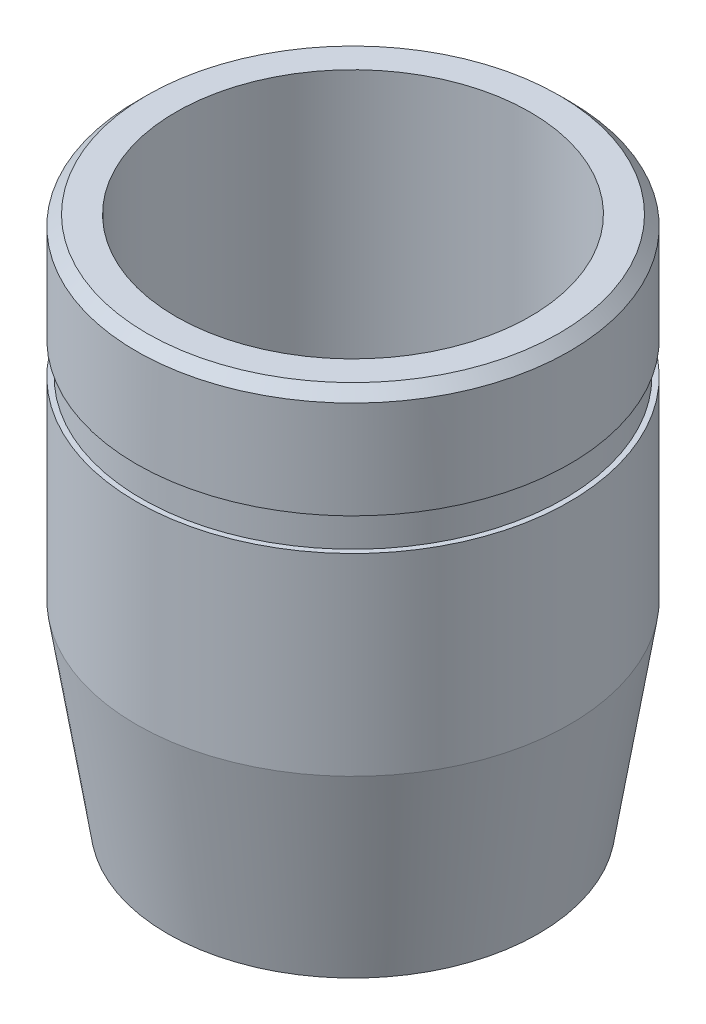
ISO-10303-21;
HEADER;
FILE_DESCRIPTION(('STEP AP214'),'2;1');
FILE_NAME('part.step','',(''),(''),'','','');
FILE_SCHEMA(('AUTOMOTIVE_DESIGN { 1 0 10303 214 1 1 1 1 }'));
ENDSEC;
DATA;
#1=APPLICATION_CONTEXT('core data for automotive mechanical design processes');
#2=APPLICATION_PROTOCOL_DEFINITION('international standard','automotive_design',2000,#1);
#3=PRODUCT_CONTEXT('',#1,'mechanical');
#4=PRODUCT('Part','Part','',(#3));
#5=PRODUCT_RELATED_PRODUCT_CATEGORY('part','',(#4));
#6=PRODUCT_DEFINITION_FORMATION('','',#4);
#7=PRODUCT_DEFINITION_CONTEXT('part definition',#1,'design');
#8=PRODUCT_DEFINITION('design','',#6,#7);
#9=PRODUCT_DEFINITION_SHAPE('','',#8);
#10=(LENGTH_UNIT() NAMED_UNIT(*) SI_UNIT(.MILLI.,.METRE.));
#11=(NAMED_UNIT(*) PLANE_ANGLE_UNIT() SI_UNIT($,.RADIAN.));
#12=(NAMED_UNIT(*) SI_UNIT($,.STERADIAN.) SOLID_ANGLE_UNIT());
#13=UNCERTAINTY_MEASURE_WITH_UNIT(LENGTH_MEASURE(1.E-05),#10,'distance_accuracy_value','');
#14=(GEOMETRIC_REPRESENTATION_CONTEXT(3) GLOBAL_UNCERTAINTY_ASSIGNED_CONTEXT((#13)) GLOBAL_UNIT_ASSIGNED_CONTEXT((#10,
#11,#12)) REPRESENTATION_CONTEXT('',''));
#15=CARTESIAN_POINT('',(0.,0.,0.));
#16=DIRECTION('',(0.,0.,1.));
#17=DIRECTION('',(1.,0.,0.));
#18=AXIS2_PLACEMENT_3D('',#15,#16,#17);
#19=CARTESIAN_POINT('',(0.,0.,0.));
#20=DIRECTION('',(0.,-1.,0.));
#21=DIRECTION('',(0.,0.,-1.));
#22=AXIS2_PLACEMENT_3D('',#19,#20,#21);
#23=CYLINDRICAL_SURFACE('',#22,15.494);
#24=CARTESIAN_POINT('',(0.,30.9626,0.));
#25=DIRECTION('',(0.,-1.,0.));
#26=DIRECTION('',(0.,0.,-1.));
#27=AXIS2_PLACEMENT_3D('',#24,#25,#26);
#28=CIRCLE('',#27,15.494);
#29=CARTESIAN_POINT('',(0.,30.9626,-15.494));
#30=VERTEX_POINT('',#29);
#31=EDGE_CURVE('E44',#30,#30,#28,.F.);
#32=ORIENTED_EDGE('',*,*,#31,.F.);
#33=EDGE_LOOP('',(#32));
#34=FACE_BOUND('',#33,.T.);
#35=CARTESIAN_POINT('',(0.,28.575,0.));
#36=DIRECTION('',(0.,-1.,0.));
#37=DIRECTION('',(0.,0.,-1.));
#38=AXIS2_PLACEMENT_3D('',#35,#36,#37);
#39=CIRCLE('',#38,15.494);
#40=CARTESIAN_POINT('',(0.,28.575,-15.494));
#41=VERTEX_POINT('',#40);
#42=EDGE_CURVE('E18',#41,#41,#39,.T.);
#43=ORIENTED_EDGE('',*,*,#42,.F.);
#44=EDGE_LOOP('',(#43));
#45=FACE_BOUND('',#44,.T.);
#46=ADVANCED_FACE('F15',(#34,#45),#23,.T.);
#47=CARTESIAN_POINT('',(15.875,28.575,0.));
#48=DIRECTION('',(0.,1.,0.));
#49=DIRECTION('',(0.,0.,1.));
#50=AXIS2_PLACEMENT_3D('',#47,#48,#49);
#51=PLANE('',#50);
#52=CARTESIAN_POINT('',(0.,28.575,0.));
#53=DIRECTION('',(0.,-1.,0.));
#54=DIRECTION('',(0.,0.,-1.));
#55=AXIS2_PLACEMENT_3D('',#52,#53,#54);
#56=CIRCLE('',#55,15.875);
#57=CARTESIAN_POINT('',(0.,28.575,-15.875));
#58=VERTEX_POINT('',#57);
#59=EDGE_CURVE('E42',#58,#58,#56,.T.);
#60=ORIENTED_EDGE('',*,*,#59,.F.);
#61=EDGE_LOOP('',(#60));
#62=FACE_BOUND('',#61,.T.);
#63=ORIENTED_EDGE('',*,*,#42,.T.);
#64=EDGE_LOOP('',(#63));
#65=FACE_BOUND('',#64,.T.);
#66=ADVANCED_FACE('F51',(#62,#65),#51,.T.);
#67=CARTESIAN_POINT('',(15.494,30.9626,0.));
#68=DIRECTION('',(0.,-1.,0.));
#69=DIRECTION('',(0.,0.,-1.));
#70=AXIS2_PLACEMENT_3D('',#67,#68,#69);
#71=PLANE('',#70);
#72=ORIENTED_EDGE('',*,*,#31,.T.);
#73=EDGE_LOOP('',(#72));
#74=FACE_BOUND('',#73,.T.);
#75=CARTESIAN_POINT('',(0.,30.9626,0.));
#76=DIRECTION('',(0.,-1.,0.));
#77=DIRECTION('',(0.,0.,-1.));
#78=AXIS2_PLACEMENT_3D('',#75,#76,#77);
#79=CIRCLE('',#78,15.875);
#80=CARTESIAN_POINT('',(0.,30.9626,-15.875));
#81=VERTEX_POINT('',#80);
#82=EDGE_CURVE('E39',#81,#81,#79,.F.);
#83=ORIENTED_EDGE('',*,*,#82,.F.);
#84=EDGE_LOOP('',(#83));
#85=FACE_BOUND('',#84,.T.);
#86=ADVANCED_FACE('F59',(#74,#85),#71,.T.);
#87=CARTESIAN_POINT('',(0.,0.,0.));
#88=DIRECTION('',(0.,-1.,0.));
#89=DIRECTION('',(0.,0.,-1.));
#90=AXIS2_PLACEMENT_3D('',#87,#88,#89);
#91=CYLINDRICAL_SURFACE('',#90,15.875);
#92=CARTESIAN_POINT('',(0.,14.4272,0.));
#93=DIRECTION('',(0.,1.,0.));
#94=DIRECTION('',(0.,0.,1.));
#95=AXIS2_PLACEMENT_3D('',#92,#93,#94);
#96=CIRCLE('',#95,15.875);
#97=CARTESIAN_POINT('',(0.,14.4272,15.875));
#98=VERTEX_POINT('',#97);
#99=EDGE_CURVE('E30',#98,#98,#96,.F.);
#100=ORIENTED_EDGE('',*,*,#99,.F.);
#101=EDGE_LOOP('',(#100));
#102=FACE_BOUND('',#101,.T.);
#103=ORIENTED_EDGE('',*,*,#59,.T.);
#104=EDGE_LOOP('',(#103));
#105=FACE_BOUND('',#104,.T.);
#106=ADVANCED_FACE('F89',(#102,#105),#91,.T.);
#107=CARTESIAN_POINT('',(0.,0.,0.));
#108=DIRECTION('',(0.,-1.,0.));
#109=DIRECTION('',(0.,0.,-1.));
#110=AXIS2_PLACEMENT_3D('',#107,#108,#109);
#111=CYLINDRICAL_SURFACE('',#110,15.875);
#112=CARTESIAN_POINT('',(0.,38.1254,0.));
#113=DIRECTION('',(0.,-1.,0.));
#114=DIRECTION('',(0.,0.,-1.));
#115=AXIS2_PLACEMENT_3D('',#112,#113,#114);
#116=CIRCLE('',#115,15.875);
#117=CARTESIAN_POINT('',(0.,38.1254,-15.875));
#118=VERTEX_POINT('',#117);
#119=EDGE_CURVE('E38',#118,#118,#116,.F.);
#120=ORIENTED_EDGE('',*,*,#119,.F.);
#121=EDGE_LOOP('',(#120));
#122=FACE_BOUND('',#121,.T.);
#123=ORIENTED_EDGE('',*,*,#82,.T.);
#124=EDGE_LOOP('',(#123));
#125=FACE_BOUND('',#124,.T.);
#126=ADVANCED_FACE('F85',(#122,#125),#111,.T.);
#127=CARTESIAN_POINT('',(0.,14.4272,0.));
#128=DIRECTION('',(0.,1.,0.));
#129=DIRECTION('',(-1.,0.,0.));
#130=AXIS2_PLACEMENT_3D('',#127,#128,#129);
#131=CONICAL_SURFACE('',#130,15.875,0.15707963267949);
#132=ORIENTED_EDGE('',*,*,#99,.T.);
#133=EDGE_LOOP('',(#132));
#134=FACE_BOUND('',#133,.T.);
#135=CARTESIAN_POINT('',(0.,0.,0.));
#136=DIRECTION('',(0.,1.,0.));
#137=DIRECTION('',(-1.,0.,0.));
#138=AXIS2_PLACEMENT_3D('',#135,#136,#137);
#139=CIRCLE('',#138,13.5899560025498);
#140=CARTESIAN_POINT('',(-13.5899560025498,0.,0.));
#141=VERTEX_POINT('',#140);
#142=EDGE_CURVE('E35',#141,#141,#139,.F.);
#143=ORIENTED_EDGE('',*,*,#142,.F.);
#144=EDGE_LOOP('',(#143));
#145=FACE_BOUND('',#144,.T.);
#146=ADVANCED_FACE('F81',(#134,#145),#131,.T.);
#147=CARTESIAN_POINT('',(0.,38.1254,0.));
#148=DIRECTION('',(0.,-1.,0.));
#149=DIRECTION('',(1.,0.,0.));
#150=AXIS2_PLACEMENT_3D('',#147,#148,#149);
#151=CONICAL_SURFACE('',#150,15.875,0.785398163397447);
#152=CARTESIAN_POINT('',(0.,38.8874,0.));
#153=DIRECTION('',(0.,-1.,0.));
#154=DIRECTION('',(1.,0.,0.));
#155=AXIS2_PLACEMENT_3D('',#152,#153,#154);
#156=CIRCLE('',#155,15.113);
#157=CARTESIAN_POINT('',(15.113,38.8874,0.));
#158=VERTEX_POINT('',#157);
#159=EDGE_CURVE('E27',#158,#158,#156,.F.);
#160=ORIENTED_EDGE('',*,*,#159,.F.);
#161=EDGE_LOOP('',(#160));
#162=FACE_BOUND('',#161,.T.);
#163=ORIENTED_EDGE('',*,*,#119,.T.);
#164=EDGE_LOOP('',(#163));
#165=FACE_BOUND('',#164,.T.);
#166=ADVANCED_FACE('F77',(#162,#165),#151,.T.);
#167=CARTESIAN_POINT('',(12.98575,0.,0.));
#168=DIRECTION('',(0.,-1.,0.));
#169=DIRECTION('',(0.,0.,-1.));
#170=AXIS2_PLACEMENT_3D('',#167,#168,#169);
#171=PLANE('',#170);
#172=CARTESIAN_POINT('',(0.,0.,0.));
#173=DIRECTION('',(0.,-1.,0.));
#174=DIRECTION('',(0.,0.,-1.));
#175=AXIS2_PLACEMENT_3D('',#172,#173,#174);
#176=CIRCLE('',#175,12.98575);
#177=CARTESIAN_POINT('',(0.,0.,-12.98575));
#178=VERTEX_POINT('',#177);
#179=EDGE_CURVE('E22',#178,#178,#176,.F.);
#180=ORIENTED_EDGE('',*,*,#179,.T.);
#181=EDGE_LOOP('',(#180));
#182=FACE_BOUND('',#181,.T.);
#183=ORIENTED_EDGE('',*,*,#142,.T.);
#184=EDGE_LOOP('',(#183));
#185=FACE_BOUND('',#184,.T.);
#186=ADVANCED_FACE('F69',(#182,#185),#171,.T.);
#187=CARTESIAN_POINT('',(15.113,38.8874,0.));
#188=DIRECTION('',(0.,1.,0.));
#189=DIRECTION('',(0.,0.,1.));
#190=AXIS2_PLACEMENT_3D('',#187,#188,#189);
#191=PLANE('',#190);
#192=ORIENTED_EDGE('',*,*,#159,.T.);
#193=EDGE_LOOP('',(#192));
#194=FACE_BOUND('',#193,.T.);
#195=CARTESIAN_POINT('',(0.,38.8874,0.));
#196=DIRECTION('',(0.,-1.,0.));
#197=DIRECTION('',(0.,0.,-1.));
#198=AXIS2_PLACEMENT_3D('',#195,#196,#197);
#199=CIRCLE('',#198,12.98575);
#200=CARTESIAN_POINT('',(0.,38.8874,-12.98575));
#201=VERTEX_POINT('',#200);
#202=EDGE_CURVE('E10',#201,#201,#199,.T.);
#203=ORIENTED_EDGE('',*,*,#202,.T.);
#204=EDGE_LOOP('',(#203));
#205=FACE_BOUND('',#204,.T.);
#206=ADVANCED_FACE('F63',(#194,#205),#191,.T.);
#207=CARTESIAN_POINT('',(0.,0.,0.));
#208=DIRECTION('',(0.,-1.,0.));
#209=DIRECTION('',(0.,0.,-1.));
#210=AXIS2_PLACEMENT_3D('',#207,#208,#209);
#211=CYLINDRICAL_SURFACE('',#210,12.98575);
#212=ORIENTED_EDGE('',*,*,#179,.F.);
#213=EDGE_LOOP('',(#212));
#214=FACE_BOUND('',#213,.T.);
#215=ORIENTED_EDGE('',*,*,#202,.F.);
#216=EDGE_LOOP('',(#215));
#217=FACE_BOUND('',#216,.T.);
#218=ADVANCED_FACE('F61',(#214,#217),#211,.F.);
#219=CLOSED_SHELL('',(#46,#66,#86,#106,#126,#146,#166,#186,#206,#218));
#220=MANIFOLD_SOLID_BREP('B1',#219);
#221=ADVANCED_BREP_SHAPE_REPRESENTATION('',(#18,#220),#14);
#222=SHAPE_DEFINITION_REPRESENTATION(#9,#221);
ENDSEC;
END-ISO-10303-21;
